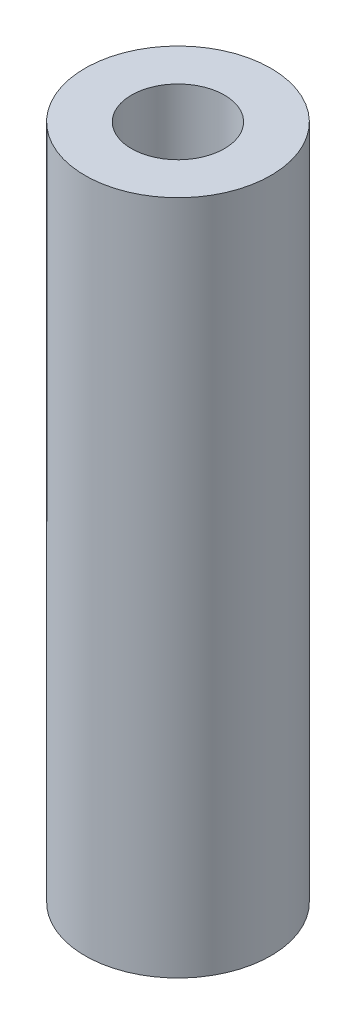
ISO-10303-21;
HEADER;
FILE_DESCRIPTION(('STEP AP214'),'2;1');
FILE_NAME('part.step','',(''),(''),'','','');
FILE_SCHEMA(('AUTOMOTIVE_DESIGN { 1 0 10303 214 1 1 1 1 }'));
ENDSEC;
DATA;
#1=APPLICATION_CONTEXT('core data for automotive mechanical design processes');
#2=APPLICATION_PROTOCOL_DEFINITION('international standard','automotive_design',2000,#1);
#3=PRODUCT_CONTEXT('',#1,'mechanical');
#4=PRODUCT('Part','Part','',(#3));
#5=PRODUCT_RELATED_PRODUCT_CATEGORY('part','',(#4));
#6=PRODUCT_DEFINITION_FORMATION('','',#4);
#7=PRODUCT_DEFINITION_CONTEXT('part definition',#1,'design');
#8=PRODUCT_DEFINITION('design','',#6,#7);
#9=PRODUCT_DEFINITION_SHAPE('','',#8);
#10=(LENGTH_UNIT() NAMED_UNIT(*) SI_UNIT(.MILLI.,.METRE.));
#11=(NAMED_UNIT(*) PLANE_ANGLE_UNIT() SI_UNIT($,.RADIAN.));
#12=(NAMED_UNIT(*) SI_UNIT($,.STERADIAN.) SOLID_ANGLE_UNIT());
#13=UNCERTAINTY_MEASURE_WITH_UNIT(LENGTH_MEASURE(1.E-05),#10,'distance_accuracy_value','');
#14=(GEOMETRIC_REPRESENTATION_CONTEXT(3) GLOBAL_UNCERTAINTY_ASSIGNED_CONTEXT((#13)) GLOBAL_UNIT_ASSIGNED_CONTEXT((#10,
#11,#12)) REPRESENTATION_CONTEXT('',''));
#15=CARTESIAN_POINT('',(0.,0.,0.));
#16=DIRECTION('',(0.,0.,1.));
#17=DIRECTION('',(1.,0.,0.));
#18=AXIS2_PLACEMENT_3D('',#15,#16,#17);
#19=CARTESIAN_POINT('',(0.,0.,0.));
#20=DIRECTION('',(0.,-1.,0.));
#21=DIRECTION('',(0.,0.,-1.));
#22=AXIS2_PLACEMENT_3D('',#19,#20,#21);
#23=CYLINDRICAL_SURFACE('',#22,5.5);
#24=CARTESIAN_POINT('',(0.,0.,0.));
#25=DIRECTION('',(0.,-1.,0.));
#26=DIRECTION('',(0.,0.,-1.));
#27=AXIS2_PLACEMENT_3D('',#24,#25,#26);
#28=CIRCLE('',#27,5.5);
#29=CARTESIAN_POINT('',(0.,0.,-5.5));
#30=VERTEX_POINT('',#29);
#31=EDGE_CURVE('E49',#30,#30,#28,.T.);
#32=ORIENTED_EDGE('',*,*,#31,.T.);
#33=EDGE_LOOP('',(#32));
#34=FACE_BOUND('',#33,.T.);
#35=CARTESIAN_POINT('',(0.,80.,0.));
#36=DIRECTION('',(0.,-1.,0.));
#37=DIRECTION('',(0.,0.,-1.));
#38=AXIS2_PLACEMENT_3D('',#35,#36,#37);
#39=CIRCLE('',#38,5.5);
#40=CARTESIAN_POINT('',(0.,80.,-5.5));
#41=VERTEX_POINT('',#40);
#42=EDGE_CURVE('E10',#41,#41,#39,.T.);
#43=ORIENTED_EDGE('',*,*,#42,.F.);
#44=EDGE_LOOP('',(#43));
#45=FACE_BOUND('',#44,.T.);
#46=ADVANCED_FACE('F35',(#34,#45),#23,.F.);
#47=CARTESIAN_POINT('',(5.5,80.,0.));
#48=DIRECTION('',(0.,1.,0.));
#49=DIRECTION('',(0.,0.,1.));
#50=AXIS2_PLACEMENT_3D('',#47,#48,#49);
#51=PLANE('',#50);
#52=ORIENTED_EDGE('',*,*,#42,.T.);
#53=EDGE_LOOP('',(#52));
#54=FACE_BOUND('',#53,.T.);
#55=CARTESIAN_POINT('',(0.,80.,0.));
#56=DIRECTION('',(0.,-1.,0.));
#57=DIRECTION('',(0.,0.,-1.));
#58=AXIS2_PLACEMENT_3D('',#55,#56,#57);
#59=CIRCLE('',#58,11.);
#60=CARTESIAN_POINT('',(0.,80.,-11.));
#61=VERTEX_POINT('',#60);
#62=EDGE_CURVE('E41',#61,#61,#59,.T.);
#63=ORIENTED_EDGE('',*,*,#62,.F.);
#64=EDGE_LOOP('',(#63));
#65=FACE_BOUND('',#64,.T.);
#66=ADVANCED_FACE('F65',(#54,#65),#51,.T.);
#67=CARTESIAN_POINT('',(0.,0.,0.));
#68=DIRECTION('',(0.,-1.,0.));
#69=DIRECTION('',(0.,0.,-1.));
#70=AXIS2_PLACEMENT_3D('',#67,#68,#69);
#71=CYLINDRICAL_SURFACE('',#70,11.);
#72=ORIENTED_EDGE('',*,*,#62,.T.);
#73=EDGE_LOOP('',(#72));
#74=FACE_BOUND('',#73,.T.);
#75=CARTESIAN_POINT('',(0.,0.,0.));
#76=DIRECTION('',(0.,-1.,0.));
#77=DIRECTION('',(0.,0.,-1.));
#78=AXIS2_PLACEMENT_3D('',#75,#76,#77);
#79=CIRCLE('',#78,11.);
#80=CARTESIAN_POINT('',(0.,0.,-11.));
#81=VERTEX_POINT('',#80);
#82=EDGE_CURVE('E45',#81,#81,#79,.T.);
#83=ORIENTED_EDGE('',*,*,#82,.F.);
#84=EDGE_LOOP('',(#83));
#85=FACE_BOUND('',#84,.T.);
#86=ADVANCED_FACE('F59',(#74,#85),#71,.T.);
#87=CARTESIAN_POINT('',(5.5,0.,0.));
#88=DIRECTION('',(0.,-1.,0.));
#89=DIRECTION('',(0.,0.,-1.));
#90=AXIS2_PLACEMENT_3D('',#87,#88,#89);
#91=PLANE('',#90);
#92=ORIENTED_EDGE('',*,*,#82,.T.);
#93=EDGE_LOOP('',(#92));
#94=FACE_BOUND('',#93,.T.);
#95=ORIENTED_EDGE('',*,*,#31,.F.);
#96=EDGE_LOOP('',(#95));
#97=FACE_BOUND('',#96,.T.);
#98=ADVANCED_FACE('F57',(#94,#97),#91,.T.);
#99=CLOSED_SHELL('',(#46,#66,#86,#98));
#100=MANIFOLD_SOLID_BREP('B2',#99);
#101=ADVANCED_BREP_SHAPE_REPRESENTATION('',(#18,#100),#14);
#102=SHAPE_DEFINITION_REPRESENTATION(#9,#101);
ENDSEC;
END-ISO-10303-21;
